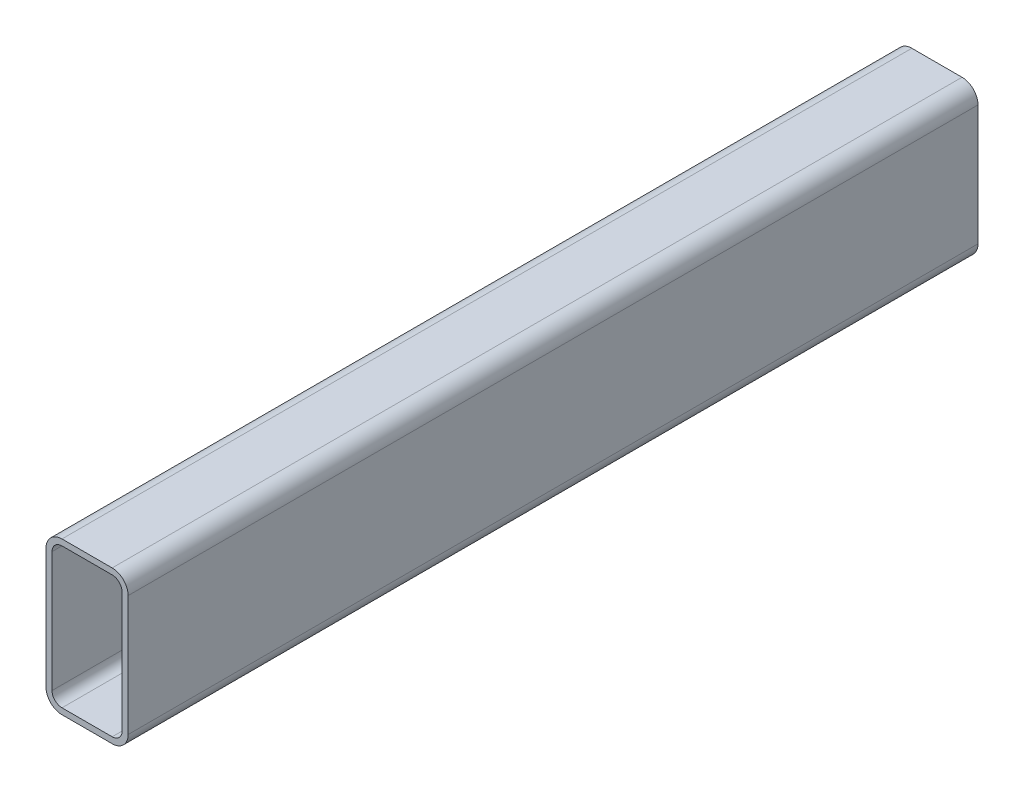
ISO-10303-21;
HEADER;
FILE_DESCRIPTION(('STEP AP214'),'2;1');
FILE_NAME('part.step','',(''),(''),'','','');
FILE_SCHEMA(('AUTOMOTIVE_DESIGN { 1 0 10303 214 1 1 1 1 }'));
ENDSEC;
DATA;
#1=APPLICATION_CONTEXT('core data for automotive mechanical design processes');
#2=APPLICATION_PROTOCOL_DEFINITION('international standard','automotive_design',2000,#1);
#3=PRODUCT_CONTEXT('',#1,'mechanical');
#4=PRODUCT('Part','Part','',(#3));
#5=PRODUCT_RELATED_PRODUCT_CATEGORY('part','',(#4));
#6=PRODUCT_DEFINITION_FORMATION('','',#4);
#7=PRODUCT_DEFINITION_CONTEXT('part definition',#1,'design');
#8=PRODUCT_DEFINITION('design','',#6,#7);
#9=PRODUCT_DEFINITION_SHAPE('','',#8);
#10=(LENGTH_UNIT() NAMED_UNIT(*) SI_UNIT(.MILLI.,.METRE.));
#11=(NAMED_UNIT(*) PLANE_ANGLE_UNIT() SI_UNIT($,.RADIAN.));
#12=(NAMED_UNIT(*) SI_UNIT($,.STERADIAN.) SOLID_ANGLE_UNIT());
#13=UNCERTAINTY_MEASURE_WITH_UNIT(LENGTH_MEASURE(1.E-05),#10,'distance_accuracy_value','');
#14=(GEOMETRIC_REPRESENTATION_CONTEXT(3) GLOBAL_UNCERTAINTY_ASSIGNED_CONTEXT((#13)) GLOBAL_UNIT_ASSIGNED_CONTEXT((#10,
#11,#12)) REPRESENTATION_CONTEXT('',''));
#15=CARTESIAN_POINT('',(0.,0.,0.));
#16=DIRECTION('',(0.,0.,1.));
#17=DIRECTION('',(1.,0.,0.));
#18=AXIS2_PLACEMENT_3D('',#15,#16,#17);
#19=CARTESIAN_POINT('',(9.001125,27.305,152.4));
#20=DIRECTION('',(0.,-1.,0.));
#21=DIRECTION('',(0.,0.,-1.));
#22=AXIS2_PLACEMENT_3D('',#19,#20,#21);
#23=PLANE('',#22);
#24=DIRECTION('',(0.,0.,-1.));
#25=VECTOR('',#24,1.);
#26=CARTESIAN_POINT('',(-9.001125,27.305,152.4));
#27=LINE('',#26,#25);
#28=CARTESIAN_POINT('',(-9.001125,27.305,152.4));
#29=VERTEX_POINT('',#28);
#30=CARTESIAN_POINT('',(-9.001125,27.305,-152.4));
#31=VERTEX_POINT('',#30);
#32=EDGE_CURVE('E118',#29,#31,#27,.T.);
#33=ORIENTED_EDGE('',*,*,#32,.F.);
#34=DIRECTION('',(1.,0.,0.));
#35=VECTOR('',#34,1.);
#36=CARTESIAN_POINT('',(9.001125,27.305,152.4));
#37=LINE('',#36,#35);
#38=CARTESIAN_POINT('',(9.001125,27.305,152.4));
#39=VERTEX_POINT('',#38);
#40=EDGE_CURVE('E115',#39,#29,#37,.F.);
#41=ORIENTED_EDGE('',*,*,#40,.F.);
#42=DIRECTION('',(0.,0.,-1.));
#43=VECTOR('',#42,1.);
#44=CARTESIAN_POINT('',(9.001125,27.305,152.4));
#45=LINE('',#44,#43);
#46=CARTESIAN_POINT('',(9.001125,27.305,-152.4));
#47=VERTEX_POINT('',#46);
#48=EDGE_CURVE('E103',#47,#39,#45,.F.);
#49=ORIENTED_EDGE('',*,*,#48,.F.);
#50=DIRECTION('',(1.,0.,0.));
#51=VECTOR('',#50,1.);
#52=CARTESIAN_POINT('',(9.001125,27.305,-152.4));
#53=LINE('',#52,#51);
#54=EDGE_CURVE('E188',#47,#31,#53,.F.);
#55=ORIENTED_EDGE('',*,*,#54,.T.);
#56=EDGE_LOOP('',(#33,#41,#49,#55));
#57=FACE_BOUND('',#56,.T.);
#58=ADVANCED_FACE('F15',(#57),#23,.F.);
#59=CARTESIAN_POINT('',(-9.001125,-27.305,152.4));
#60=DIRECTION('',(0.,1.,0.));
#61=DIRECTION('',(0.,0.,1.));
#62=AXIS2_PLACEMENT_3D('',#59,#60,#61);
#63=PLANE('',#62);
#64=DIRECTION('',(0.,0.,-1.));
#65=VECTOR('',#64,1.);
#66=CARTESIAN_POINT('',(9.001125,-27.305,152.4));
#67=LINE('',#66,#65);
#68=CARTESIAN_POINT('',(9.001125,-27.305,152.4));
#69=VERTEX_POINT('',#68);
#70=CARTESIAN_POINT('',(9.001125,-27.305,-152.4));
#71=VERTEX_POINT('',#70);
#72=EDGE_CURVE('E153',#69,#71,#67,.T.);
#73=ORIENTED_EDGE('',*,*,#72,.F.);
#74=DIRECTION('',(1.,0.,0.));
#75=VECTOR('',#74,1.);
#76=CARTESIAN_POINT('',(9.001125,-27.305,152.4));
#77=LINE('',#76,#75);
#78=CARTESIAN_POINT('',(-9.001125,-27.305,152.4));
#79=VERTEX_POINT('',#78);
#80=EDGE_CURVE('E122',#79,#69,#77,.T.);
#81=ORIENTED_EDGE('',*,*,#80,.F.);
#82=DIRECTION('',(0.,0.,-1.));
#83=VECTOR('',#82,1.);
#84=CARTESIAN_POINT('',(-9.001125,-27.305,152.4));
#85=LINE('',#84,#83);
#86=CARTESIAN_POINT('',(-9.001125,-27.305,-152.4));
#87=VERTEX_POINT('',#86);
#88=EDGE_CURVE('E156',#87,#79,#85,.F.);
#89=ORIENTED_EDGE('',*,*,#88,.F.);
#90=DIRECTION('',(1.,0.,0.));
#91=VECTOR('',#90,1.);
#92=CARTESIAN_POINT('',(9.001125,-27.305,-152.4));
#93=LINE('',#92,#91);
#94=EDGE_CURVE('E183',#87,#71,#93,.T.);
#95=ORIENTED_EDGE('',*,*,#94,.T.);
#96=EDGE_LOOP('',(#73,#81,#89,#95));
#97=FACE_BOUND('',#96,.T.);
#98=ADVANCED_FACE('F211',(#97),#63,.F.);
#99=CARTESIAN_POINT('',(9.001125,-21.574125,152.4));
#100=DIRECTION('',(0.,0.,-1.));
#101=DIRECTION('',(-1.,0.,0.));
#102=AXIS2_PLACEMENT_3D('',#99,#100,#101);
#103=CYLINDRICAL_SURFACE('',#102,5.730875);
#104=CARTESIAN_POINT('',(9.001125,-21.574125,152.4));
#105=DIRECTION('',(0.,0.,-1.));
#106=DIRECTION('',(-1.,0.,0.));
#107=AXIS2_PLACEMENT_3D('',#104,#105,#106);
#108=CIRCLE('',#107,5.730875);
#109=CARTESIAN_POINT('',(14.732,-21.574125,152.4));
#110=VERTEX_POINT('',#109);
#111=EDGE_CURVE('E203',#69,#110,#108,.F.);
#112=ORIENTED_EDGE('',*,*,#111,.F.);
#113=ORIENTED_EDGE('',*,*,#72,.T.);
#114=CARTESIAN_POINT('',(9.001125,-21.574125,-152.4));
#115=DIRECTION('',(0.,0.,-1.));
#116=DIRECTION('',(-1.,0.,0.));
#117=AXIS2_PLACEMENT_3D('',#114,#115,#116);
#118=CIRCLE('',#117,5.730875);
#119=CARTESIAN_POINT('',(14.732,-21.574125,-152.4));
#120=VERTEX_POINT('',#119);
#121=EDGE_CURVE('E180',#71,#120,#118,.F.);
#122=ORIENTED_EDGE('',*,*,#121,.T.);
#123=DIRECTION('',(0.,0.,1.));
#124=VECTOR('',#123,1.);
#125=CARTESIAN_POINT('',(14.732,-21.574125,152.4));
#126=LINE('',#125,#124);
#127=EDGE_CURVE('E111',#120,#110,#126,.T.);
#128=ORIENTED_EDGE('',*,*,#127,.T.);
#129=EDGE_LOOP('',(#112,#113,#122,#128));
#130=FACE_BOUND('',#129,.T.);
#131=ADVANCED_FACE('F214',(#130),#103,.T.);
#132=CARTESIAN_POINT('',(14.732,21.574125,152.4));
#133=DIRECTION('',(-1.,0.,0.));
#134=DIRECTION('',(0.,0.,1.));
#135=AXIS2_PLACEMENT_3D('',#132,#133,#134);
#136=PLANE('',#135);
#137=DIRECTION('',(0.,0.,-1.));
#138=VECTOR('',#137,1.);
#139=CARTESIAN_POINT('',(14.732,21.574125,152.4));
#140=LINE('',#139,#138);
#141=CARTESIAN_POINT('',(14.732,21.574125,152.4));
#142=VERTEX_POINT('',#141);
#143=CARTESIAN_POINT('',(14.732,21.574125,-152.4));
#144=VERTEX_POINT('',#143);
#145=EDGE_CURVE('E96',#142,#144,#140,.T.);
#146=ORIENTED_EDGE('',*,*,#145,.F.);
#147=DIRECTION('',(0.,1.,0.));
#148=VECTOR('',#147,1.);
#149=CARTESIAN_POINT('',(14.732,21.574125,152.4));
#150=LINE('',#149,#148);
#151=EDGE_CURVE('E117',#110,#142,#150,.T.);
#152=ORIENTED_EDGE('',*,*,#151,.F.);
#153=ORIENTED_EDGE('',*,*,#127,.F.);
#154=DIRECTION('',(0.,1.,0.));
#155=VECTOR('',#154,1.);
#156=CARTESIAN_POINT('',(14.732,21.574125,-152.4));
#157=LINE('',#156,#155);
#158=EDGE_CURVE('E179',#120,#144,#157,.T.);
#159=ORIENTED_EDGE('',*,*,#158,.T.);
#160=EDGE_LOOP('',(#146,#152,#153,#159));
#161=FACE_BOUND('',#160,.T.);
#162=ADVANCED_FACE('F217',(#161),#136,.F.);
#163=CARTESIAN_POINT('',(9.001125,21.574125,152.4));
#164=DIRECTION('',(0.,0.,-1.));
#165=DIRECTION('',(-1.,0.,0.));
#166=AXIS2_PLACEMENT_3D('',#163,#164,#165);
#167=CYLINDRICAL_SURFACE('',#166,5.730875);
#168=CARTESIAN_POINT('',(9.001125,21.574125,152.4));
#169=DIRECTION('',(0.,0.,-1.));
#170=DIRECTION('',(-1.,0.,0.));
#171=AXIS2_PLACEMENT_3D('',#168,#169,#170);
#172=CIRCLE('',#171,5.730875);
#173=EDGE_CURVE('E18',#142,#39,#172,.F.);
#174=ORIENTED_EDGE('',*,*,#173,.F.);
#175=ORIENTED_EDGE('',*,*,#145,.T.);
#176=CARTESIAN_POINT('',(9.001125,21.574125,-152.4));
#177=DIRECTION('',(0.,0.,-1.));
#178=DIRECTION('',(-1.,0.,0.));
#179=AXIS2_PLACEMENT_3D('',#176,#177,#178);
#180=CIRCLE('',#179,5.730875);
#181=EDGE_CURVE('E107',#144,#47,#180,.F.);
#182=ORIENTED_EDGE('',*,*,#181,.T.);
#183=ORIENTED_EDGE('',*,*,#48,.T.);
#184=EDGE_LOOP('',(#174,#175,#182,#183));
#185=FACE_BOUND('',#184,.T.);
#186=ADVANCED_FACE('F105',(#185),#167,.T.);
#187=CARTESIAN_POINT('',(9.001125,25.146,152.4));
#188=DIRECTION('',(0.,-1.,0.));
#189=DIRECTION('',(0.,0.,-1.));
#190=AXIS2_PLACEMENT_3D('',#187,#188,#189);
#191=PLANE('',#190);
#192=DIRECTION('',(1.,0.,0.));
#193=VECTOR('',#192,1.);
#194=CARTESIAN_POINT('',(9.001125,25.146,152.4));
#195=LINE('',#194,#193);
#196=CARTESIAN_POINT('',(-9.001125,25.146,152.4));
#197=VERTEX_POINT('',#196);
#198=CARTESIAN_POINT('',(9.001125,25.146,152.4));
#199=VERTEX_POINT('',#198);
#200=EDGE_CURVE('E198',#197,#199,#195,.T.);
#201=ORIENTED_EDGE('',*,*,#200,.F.);
#202=DIRECTION('',(0.,0.,-1.));
#203=VECTOR('',#202,1.);
#204=CARTESIAN_POINT('',(-9.001125,25.146,152.4));
#205=LINE('',#204,#203);
#206=CARTESIAN_POINT('',(-9.001125,25.146,-152.4));
#207=VERTEX_POINT('',#206);
#208=EDGE_CURVE('E126',#197,#207,#205,.T.);
#209=ORIENTED_EDGE('',*,*,#208,.T.);
#210=DIRECTION('',(1.,0.,0.));
#211=VECTOR('',#210,1.);
#212=CARTESIAN_POINT('',(9.001125,25.146,-152.4));
#213=LINE('',#212,#211);
#214=CARTESIAN_POINT('',(9.001125,25.146,-152.4));
#215=VERTEX_POINT('',#214);
#216=EDGE_CURVE('E177',#207,#215,#213,.T.);
#217=ORIENTED_EDGE('',*,*,#216,.T.);
#218=DIRECTION('',(0.,0.,-1.));
#219=VECTOR('',#218,1.);
#220=CARTESIAN_POINT('',(9.001125,25.146,152.4));
#221=LINE('',#220,#219);
#222=EDGE_CURVE('E147',#215,#199,#221,.F.);
#223=ORIENTED_EDGE('',*,*,#222,.T.);
#224=EDGE_LOOP('',(#201,#209,#217,#223));
#225=FACE_BOUND('',#224,.T.);
#226=ADVANCED_FACE('F225',(#225),#191,.T.);
#227=CARTESIAN_POINT('',(9.001125,21.574125,152.4));
#228=DIRECTION('',(0.,0.,-1.));
#229=DIRECTION('',(-1.,0.,0.));
#230=AXIS2_PLACEMENT_3D('',#227,#228,#229);
#231=CYLINDRICAL_SURFACE('',#230,3.571875);
#232=DIRECTION('',(0.,0.,1.));
#233=VECTOR('',#232,1.);
#234=CARTESIAN_POINT('',(12.573,21.574125,152.4));
#235=LINE('',#234,#233);
#236=CARTESIAN_POINT('',(12.573,21.574125,152.4));
#237=VERTEX_POINT('',#236);
#238=CARTESIAN_POINT('',(12.573,21.574125,-152.4));
#239=VERTEX_POINT('',#238);
#240=EDGE_CURVE('E144',#237,#239,#235,.F.);
#241=ORIENTED_EDGE('',*,*,#240,.F.);
#242=CARTESIAN_POINT('',(9.001125,21.574125,152.4));
#243=DIRECTION('',(0.,0.,-1.));
#244=DIRECTION('',(-1.,0.,0.));
#245=AXIS2_PLACEMENT_3D('',#242,#243,#244);
#246=CIRCLE('',#245,3.571875);
#247=EDGE_CURVE('E196',#199,#237,#246,.T.);
#248=ORIENTED_EDGE('',*,*,#247,.F.);
#249=ORIENTED_EDGE('',*,*,#222,.F.);
#250=CARTESIAN_POINT('',(9.001125,21.574125,-152.4));
#251=DIRECTION('',(0.,0.,-1.));
#252=DIRECTION('',(-1.,0.,0.));
#253=AXIS2_PLACEMENT_3D('',#250,#251,#252);
#254=CIRCLE('',#253,3.571875);
#255=EDGE_CURVE('E174',#215,#239,#254,.T.);
#256=ORIENTED_EDGE('',*,*,#255,.T.);
#257=EDGE_LOOP('',(#241,#248,#249,#256));
#258=FACE_BOUND('',#257,.T.);
#259=ADVANCED_FACE('F274',(#258),#231,.F.);
#260=CARTESIAN_POINT('',(12.573,21.574125,152.4));
#261=DIRECTION('',(-1.,0.,0.));
#262=DIRECTION('',(0.,0.,1.));
#263=AXIS2_PLACEMENT_3D('',#260,#261,#262);
#264=PLANE('',#263);
#265=DIRECTION('',(0.,1.,0.));
#266=VECTOR('',#265,1.);
#267=CARTESIAN_POINT('',(12.573,21.574125,152.4));
#268=LINE('',#267,#266);
#269=CARTESIAN_POINT('',(12.573,-21.574125,152.4));
#270=VERTEX_POINT('',#269);
#271=EDGE_CURVE('E195',#237,#270,#268,.F.);
#272=ORIENTED_EDGE('',*,*,#271,.F.);
#273=ORIENTED_EDGE('',*,*,#240,.T.);
#274=DIRECTION('',(0.,1.,0.));
#275=VECTOR('',#274,1.);
#276=CARTESIAN_POINT('',(12.573,21.574125,-152.4));
#277=LINE('',#276,#275);
#278=CARTESIAN_POINT('',(12.573,-21.574125,-152.4));
#279=VERTEX_POINT('',#278);
#280=EDGE_CURVE('E173',#239,#279,#277,.F.);
#281=ORIENTED_EDGE('',*,*,#280,.T.);
#282=DIRECTION('',(0.,0.,-1.));
#283=VECTOR('',#282,1.);
#284=CARTESIAN_POINT('',(12.573,-21.574125,152.4));
#285=LINE('',#284,#283);
#286=EDGE_CURVE('E141',#279,#270,#285,.F.);
#287=ORIENTED_EDGE('',*,*,#286,.T.);
#288=EDGE_LOOP('',(#272,#273,#281,#287));
#289=FACE_BOUND('',#288,.T.);
#290=ADVANCED_FACE('F270',(#289),#264,.T.);
#291=CARTESIAN_POINT('',(9.001125,-21.574125,152.4));
#292=DIRECTION('',(0.,0.,-1.));
#293=DIRECTION('',(-1.,0.,0.));
#294=AXIS2_PLACEMENT_3D('',#291,#292,#293);
#295=CYLINDRICAL_SURFACE('',#294,3.571875);
#296=DIRECTION('',(0.,0.,1.));
#297=VECTOR('',#296,1.);
#298=CARTESIAN_POINT('',(9.001125,-25.146,152.4));
#299=LINE('',#298,#297);
#300=CARTESIAN_POINT('',(9.001125,-25.146,152.4));
#301=VERTEX_POINT('',#300);
#302=CARTESIAN_POINT('',(9.001125,-25.146,-152.4));
#303=VERTEX_POINT('',#302);
#304=EDGE_CURVE('E138',#301,#303,#299,.F.);
#305=ORIENTED_EDGE('',*,*,#304,.F.);
#306=CARTESIAN_POINT('',(9.001125,-21.574125,152.4));
#307=DIRECTION('',(0.,0.,-1.));
#308=DIRECTION('',(-1.,0.,0.));
#309=AXIS2_PLACEMENT_3D('',#306,#307,#308);
#310=CIRCLE('',#309,3.571875);
#311=EDGE_CURVE('E193',#270,#301,#310,.T.);
#312=ORIENTED_EDGE('',*,*,#311,.F.);
#313=ORIENTED_EDGE('',*,*,#286,.F.);
#314=CARTESIAN_POINT('',(9.001125,-21.574125,-152.4));
#315=DIRECTION('',(0.,0.,-1.));
#316=DIRECTION('',(-1.,0.,0.));
#317=AXIS2_PLACEMENT_3D('',#314,#315,#316);
#318=CIRCLE('',#317,3.571875);
#319=EDGE_CURVE('E170',#279,#303,#318,.T.);
#320=ORIENTED_EDGE('',*,*,#319,.T.);
#321=EDGE_LOOP('',(#305,#312,#313,#320));
#322=FACE_BOUND('',#321,.T.);
#323=ADVANCED_FACE('F266',(#322),#295,.F.);
#324=CARTESIAN_POINT('',(-9.001125,-25.146,152.4));
#325=DIRECTION('',(0.,1.,0.));
#326=DIRECTION('',(0.,0.,1.));
#327=AXIS2_PLACEMENT_3D('',#324,#325,#326);
#328=PLANE('',#327);
#329=DIRECTION('',(1.,0.,0.));
#330=VECTOR('',#329,1.);
#331=CARTESIAN_POINT('',(9.001125,-25.146,152.4));
#332=LINE('',#331,#330);
#333=CARTESIAN_POINT('',(-9.001125,-25.146,152.4));
#334=VERTEX_POINT('',#333);
#335=EDGE_CURVE('E192',#301,#334,#332,.F.);
#336=ORIENTED_EDGE('',*,*,#335,.F.);
#337=ORIENTED_EDGE('',*,*,#304,.T.);
#338=DIRECTION('',(1.,0.,0.));
#339=VECTOR('',#338,1.);
#340=CARTESIAN_POINT('',(9.001125,-25.146,-152.4));
#341=LINE('',#340,#339);
#342=CARTESIAN_POINT('',(-9.001125,-25.146,-152.4));
#343=VERTEX_POINT('',#342);
#344=EDGE_CURVE('E169',#303,#343,#341,.F.);
#345=ORIENTED_EDGE('',*,*,#344,.T.);
#346=DIRECTION('',(0.,0.,-1.));
#347=VECTOR('',#346,1.);
#348=CARTESIAN_POINT('',(-9.001125,-25.146,152.4));
#349=LINE('',#348,#347);
#350=EDGE_CURVE('E135',#343,#334,#349,.F.);
#351=ORIENTED_EDGE('',*,*,#350,.T.);
#352=EDGE_LOOP('',(#336,#337,#345,#351));
#353=FACE_BOUND('',#352,.T.);
#354=ADVANCED_FACE('F262',(#353),#328,.T.);
#355=CARTESIAN_POINT('',(-9.001125,-21.574125,152.4));
#356=DIRECTION('',(0.,0.,-1.));
#357=DIRECTION('',(-1.,0.,0.));
#358=AXIS2_PLACEMENT_3D('',#355,#356,#357);
#359=CYLINDRICAL_SURFACE('',#358,3.571875);
#360=DIRECTION('',(0.,0.,-1.));
#361=VECTOR('',#360,1.);
#362=CARTESIAN_POINT('',(-12.573,-21.574125,152.4));
#363=LINE('',#362,#361);
#364=CARTESIAN_POINT('',(-12.573,-21.574125,152.4));
#365=VERTEX_POINT('',#364);
#366=CARTESIAN_POINT('',(-12.573,-21.574125,-152.4));
#367=VERTEX_POINT('',#366);
#368=EDGE_CURVE('E132',#365,#367,#363,.T.);
#369=ORIENTED_EDGE('',*,*,#368,.F.);
#370=CARTESIAN_POINT('',(-9.001125,-21.574125,152.4));
#371=DIRECTION('',(0.,0.,-1.));
#372=DIRECTION('',(-1.,0.,0.));
#373=AXIS2_PLACEMENT_3D('',#370,#371,#372);
#374=CIRCLE('',#373,3.571875);
#375=EDGE_CURVE('E159',#334,#365,#374,.T.);
#376=ORIENTED_EDGE('',*,*,#375,.F.);
#377=ORIENTED_EDGE('',*,*,#350,.F.);
#378=CARTESIAN_POINT('',(-9.001125,-21.574125,-152.4));
#379=DIRECTION('',(0.,0.,-1.));
#380=DIRECTION('',(-1.,0.,0.));
#381=AXIS2_PLACEMENT_3D('',#378,#379,#380);
#382=CIRCLE('',#381,3.571875);
#383=EDGE_CURVE('E166',#343,#367,#382,.T.);
#384=ORIENTED_EDGE('',*,*,#383,.T.);
#385=EDGE_LOOP('',(#369,#376,#377,#384));
#386=FACE_BOUND('',#385,.T.);
#387=ADVANCED_FACE('F258',(#386),#359,.F.);
#388=CARTESIAN_POINT('',(-12.573,-21.574125,152.4));
#389=DIRECTION('',(1.,0.,0.));
#390=DIRECTION('',(0.,0.,-1.));
#391=AXIS2_PLACEMENT_3D('',#388,#389,#390);
#392=PLANE('',#391);
#393=DIRECTION('',(0.,1.,0.));
#394=VECTOR('',#393,1.);
#395=CARTESIAN_POINT('',(-12.573,21.574125,152.4));
#396=LINE('',#395,#394);
#397=CARTESIAN_POINT('',(-12.573,21.574125,152.4));
#398=VERTEX_POINT('',#397);
#399=EDGE_CURVE('E202',#365,#398,#396,.T.);
#400=ORIENTED_EDGE('',*,*,#399,.F.);
#401=ORIENTED_EDGE('',*,*,#368,.T.);
#402=DIRECTION('',(0.,1.,0.));
#403=VECTOR('',#402,1.);
#404=CARTESIAN_POINT('',(-12.573,21.574125,-152.4));
#405=LINE('',#404,#403);
#406=CARTESIAN_POINT('',(-12.573,21.574125,-152.4));
#407=VERTEX_POINT('',#406);
#408=EDGE_CURVE('E165',#367,#407,#405,.T.);
#409=ORIENTED_EDGE('',*,*,#408,.T.);
#410=DIRECTION('',(0.,0.,-1.));
#411=VECTOR('',#410,1.);
#412=CARTESIAN_POINT('',(-12.573,21.574125,152.4));
#413=LINE('',#412,#411);
#414=EDGE_CURVE('E129',#407,#398,#413,.F.);
#415=ORIENTED_EDGE('',*,*,#414,.T.);
#416=EDGE_LOOP('',(#400,#401,#409,#415));
#417=FACE_BOUND('',#416,.T.);
#418=ADVANCED_FACE('F254',(#417),#392,.T.);
#419=CARTESIAN_POINT('',(-9.001125,21.574125,152.4));
#420=DIRECTION('',(0.,0.,-1.));
#421=DIRECTION('',(-1.,0.,0.));
#422=AXIS2_PLACEMENT_3D('',#419,#420,#421);
#423=CYLINDRICAL_SURFACE('',#422,3.571875);
#424=ORIENTED_EDGE('',*,*,#208,.F.);
#425=CARTESIAN_POINT('',(-9.001125,21.574125,152.4));
#426=DIRECTION('',(0.,0.,-1.));
#427=DIRECTION('',(-1.,0.,0.));
#428=AXIS2_PLACEMENT_3D('',#425,#426,#427);
#429=CIRCLE('',#428,3.571875);
#430=EDGE_CURVE('E199',#398,#197,#429,.T.);
#431=ORIENTED_EDGE('',*,*,#430,.F.);
#432=ORIENTED_EDGE('',*,*,#414,.F.);
#433=CARTESIAN_POINT('',(-9.001125,21.574125,-152.4));
#434=DIRECTION('',(0.,0.,-1.));
#435=DIRECTION('',(-1.,0.,0.));
#436=AXIS2_PLACEMENT_3D('',#433,#434,#435);
#437=CIRCLE('',#436,3.571875);
#438=EDGE_CURVE('E161',#407,#207,#437,.T.);
#439=ORIENTED_EDGE('',*,*,#438,.T.);
#440=EDGE_LOOP('',(#424,#431,#432,#439));
#441=FACE_BOUND('',#440,.T.);
#442=ADVANCED_FACE('F250',(#441),#423,.F.);
#443=CARTESIAN_POINT('',(-9.001125,21.574125,152.4));
#444=DIRECTION('',(0.,0.,-1.));
#445=DIRECTION('',(-1.,0.,0.));
#446=AXIS2_PLACEMENT_3D('',#443,#444,#445);
#447=CYLINDRICAL_SURFACE('',#446,5.730875);
#448=CARTESIAN_POINT('',(-9.001125,21.574125,152.4));
#449=DIRECTION('',(0.,0.,-1.));
#450=DIRECTION('',(-1.,0.,0.));
#451=AXIS2_PLACEMENT_3D('',#448,#449,#450);
#452=CIRCLE('',#451,5.730875);
#453=CARTESIAN_POINT('',(-14.732,21.574125,152.4));
#454=VERTEX_POINT('',#453);
#455=EDGE_CURVE('E120',#29,#454,#452,.F.);
#456=ORIENTED_EDGE('',*,*,#455,.F.);
#457=ORIENTED_EDGE('',*,*,#32,.T.);
#458=CARTESIAN_POINT('',(-9.001125,21.574125,-152.4));
#459=DIRECTION('',(0.,0.,-1.));
#460=DIRECTION('',(-1.,0.,0.));
#461=AXIS2_PLACEMENT_3D('',#458,#459,#460);
#462=CIRCLE('',#461,5.730875);
#463=CARTESIAN_POINT('',(-14.732,21.574125,-152.4));
#464=VERTEX_POINT('',#463);
#465=EDGE_CURVE('E185',#31,#464,#462,.F.);
#466=ORIENTED_EDGE('',*,*,#465,.T.);
#467=DIRECTION('',(0.,0.,-1.));
#468=VECTOR('',#467,1.);
#469=CARTESIAN_POINT('',(-14.732,21.574125,152.4));
#470=LINE('',#469,#468);
#471=EDGE_CURVE('E164',#464,#454,#470,.F.);
#472=ORIENTED_EDGE('',*,*,#471,.T.);
#473=EDGE_LOOP('',(#456,#457,#466,#472));
#474=FACE_BOUND('',#473,.T.);
#475=ADVANCED_FACE('F246',(#474),#447,.T.);
#476=CARTESIAN_POINT('',(9.001125,21.574125,152.4));
#477=DIRECTION('',(0.,0.,1.));
#478=DIRECTION('',(1.,0.,0.));
#479=AXIS2_PLACEMENT_3D('',#476,#477,#478);
#480=PLANE('',#479);
#481=ORIENTED_EDGE('',*,*,#335,.T.);
#482=ORIENTED_EDGE('',*,*,#375,.T.);
#483=ORIENTED_EDGE('',*,*,#399,.T.);
#484=ORIENTED_EDGE('',*,*,#430,.T.);
#485=ORIENTED_EDGE('',*,*,#200,.T.);
#486=ORIENTED_EDGE('',*,*,#247,.T.);
#487=ORIENTED_EDGE('',*,*,#271,.T.);
#488=ORIENTED_EDGE('',*,*,#311,.T.);
#489=EDGE_LOOP('',(#481,#482,#483,#484,#485,#486,#487,#488));
#490=FACE_BOUND('',#489,.T.);
#491=ORIENTED_EDGE('',*,*,#111,.T.);
#492=ORIENTED_EDGE('',*,*,#151,.T.);
#493=ORIENTED_EDGE('',*,*,#173,.T.);
#494=ORIENTED_EDGE('',*,*,#40,.T.);
#495=ORIENTED_EDGE('',*,*,#455,.T.);
#496=DIRECTION('',(0.,1.,0.));
#497=VECTOR('',#496,1.);
#498=CARTESIAN_POINT('',(-14.732,-21.574125,152.4));
#499=LINE('',#498,#497);
#500=CARTESIAN_POINT('',(-14.732,-21.574125,152.4));
#501=VERTEX_POINT('',#500);
#502=EDGE_CURVE('E328',#454,#501,#499,.F.);
#503=ORIENTED_EDGE('',*,*,#502,.T.);
#504=CARTESIAN_POINT('',(-9.001125,-21.574125,152.4));
#505=DIRECTION('',(0.,0.,-1.));
#506=DIRECTION('',(-1.,0.,0.));
#507=AXIS2_PLACEMENT_3D('',#504,#505,#506);
#508=CIRCLE('',#507,5.730875);
#509=EDGE_CURVE('E158',#79,#501,#508,.T.);
#510=ORIENTED_EDGE('',*,*,#509,.F.);
#511=ORIENTED_EDGE('',*,*,#80,.T.);
#512=EDGE_LOOP('',(#491,#492,#493,#494,#495,#503,#510,#511));
#513=FACE_BOUND('',#512,.T.);
#514=ADVANCED_FACE('F114',(#490,#513),#480,.T.);
#515=CARTESIAN_POINT('',(-9.001125,-21.574125,152.4));
#516=DIRECTION('',(0.,0.,-1.));
#517=DIRECTION('',(-1.,0.,0.));
#518=AXIS2_PLACEMENT_3D('',#515,#516,#517);
#519=CYLINDRICAL_SURFACE('',#518,5.730875);
#520=ORIENTED_EDGE('',*,*,#509,.T.);
#521=DIRECTION('',(0.,0.,-1.));
#522=VECTOR('',#521,1.);
#523=CARTESIAN_POINT('',(-14.732,-21.574125,152.4));
#524=LINE('',#523,#522);
#525=CARTESIAN_POINT('',(-14.732,-21.574125,-152.4));
#526=VERTEX_POINT('',#525);
#527=EDGE_CURVE('E24',#501,#526,#524,.T.);
#528=ORIENTED_EDGE('',*,*,#527,.T.);
#529=CARTESIAN_POINT('',(-9.001125,-21.574125,-152.4));
#530=DIRECTION('',(0.,0.,-1.));
#531=DIRECTION('',(-1.,0.,0.));
#532=AXIS2_PLACEMENT_3D('',#529,#530,#531);
#533=CIRCLE('',#532,5.730875);
#534=EDGE_CURVE('E32',#526,#87,#533,.F.);
#535=ORIENTED_EDGE('',*,*,#534,.T.);
#536=ORIENTED_EDGE('',*,*,#88,.T.);
#537=EDGE_LOOP('',(#520,#528,#535,#536));
#538=FACE_BOUND('',#537,.T.);
#539=ADVANCED_FACE('F236',(#538),#519,.T.);
#540=CARTESIAN_POINT('',(9.001125,21.574125,-152.4));
#541=DIRECTION('',(0.,0.,1.));
#542=DIRECTION('',(1.,0.,0.));
#543=AXIS2_PLACEMENT_3D('',#540,#541,#542);
#544=PLANE('',#543);
#545=ORIENTED_EDGE('',*,*,#408,.F.);
#546=ORIENTED_EDGE('',*,*,#383,.F.);
#547=ORIENTED_EDGE('',*,*,#344,.F.);
#548=ORIENTED_EDGE('',*,*,#319,.F.);
#549=ORIENTED_EDGE('',*,*,#280,.F.);
#550=ORIENTED_EDGE('',*,*,#255,.F.);
#551=ORIENTED_EDGE('',*,*,#216,.F.);
#552=ORIENTED_EDGE('',*,*,#438,.F.);
#553=EDGE_LOOP('',(#545,#546,#547,#548,#549,#550,#551,#552));
#554=FACE_BOUND('',#553,.T.);
#555=ORIENTED_EDGE('',*,*,#158,.F.);
#556=ORIENTED_EDGE('',*,*,#121,.F.);
#557=ORIENTED_EDGE('',*,*,#94,.F.);
#558=ORIENTED_EDGE('',*,*,#534,.F.);
#559=DIRECTION('',(0.,1.,0.));
#560=VECTOR('',#559,1.);
#561=CARTESIAN_POINT('',(-14.732,-21.574125,-152.4));
#562=LINE('',#561,#560);
#563=EDGE_CURVE('E9',#526,#464,#562,.T.);
#564=ORIENTED_EDGE('',*,*,#563,.T.);
#565=ORIENTED_EDGE('',*,*,#465,.F.);
#566=ORIENTED_EDGE('',*,*,#54,.F.);
#567=ORIENTED_EDGE('',*,*,#181,.F.);
#568=EDGE_LOOP('',(#555,#556,#557,#558,#564,#565,#566,#567));
#569=FACE_BOUND('',#568,.T.);
#570=ADVANCED_FACE('F230',(#554,#569),#544,.F.);
#571=CARTESIAN_POINT('',(-14.732,-21.574125,152.4));
#572=DIRECTION('',(1.,0.,0.));
#573=DIRECTION('',(0.,0.,-1.));
#574=AXIS2_PLACEMENT_3D('',#571,#572,#573);
#575=PLANE('',#574);
#576=ORIENTED_EDGE('',*,*,#527,.F.);
#577=ORIENTED_EDGE('',*,*,#502,.F.);
#578=ORIENTED_EDGE('',*,*,#471,.F.);
#579=ORIENTED_EDGE('',*,*,#563,.F.);
#580=EDGE_LOOP('',(#576,#577,#578,#579));
#581=FACE_BOUND('',#580,.T.);
#582=ADVANCED_FACE('F228',(#581),#575,.F.);
#583=CLOSED_SHELL('',(#58,#98,#131,#162,#186,#226,#259,#290,#323,#354,#387,#418,#442,#475,#514,
#539,#570,#582));
#584=MANIFOLD_SOLID_BREP('B1',#583);
#585=ADVANCED_BREP_SHAPE_REPRESENTATION('',(#18,#584),#14);
#586=SHAPE_DEFINITION_REPRESENTATION(#9,#585);
ENDSEC;
END-ISO-10303-21;
